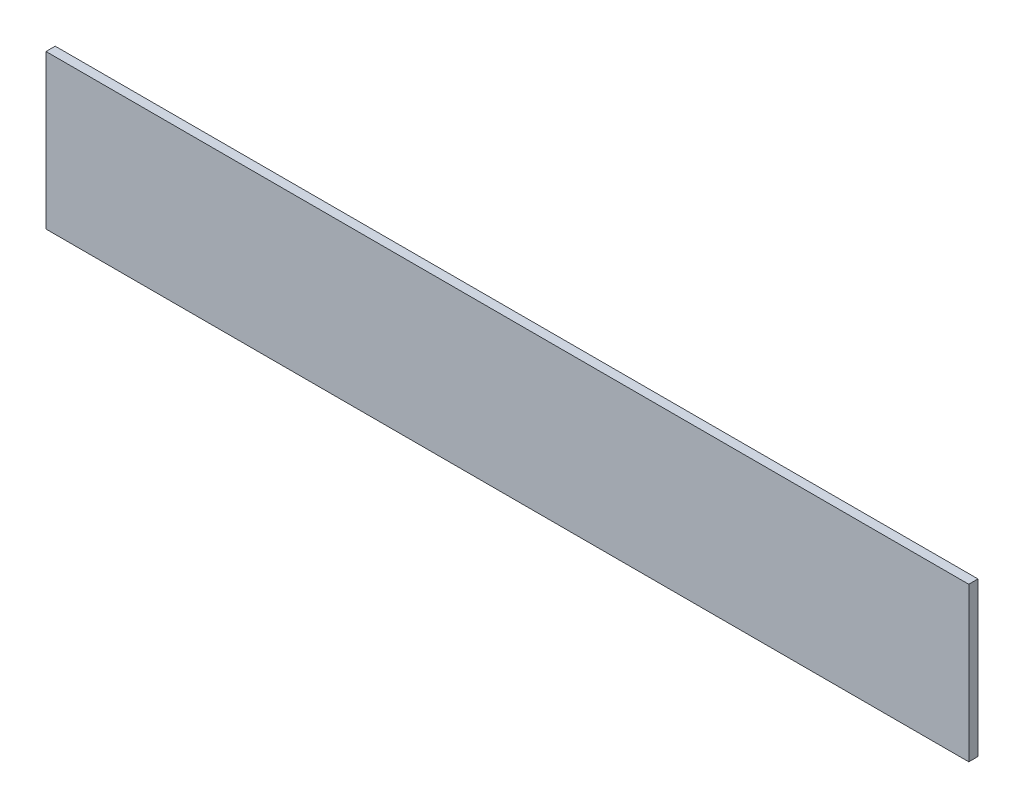
ISO-10303-21;
HEADER;
FILE_DESCRIPTION(('STEP AP214'),'2;1');
FILE_NAME('part.step','',(''),(''),'','','');
FILE_SCHEMA(('AUTOMOTIVE_DESIGN { 1 0 10303 214 1 1 1 1 }'));
ENDSEC;
DATA;
#1=APPLICATION_CONTEXT('core data for automotive mechanical design processes');
#2=APPLICATION_PROTOCOL_DEFINITION('international standard','automotive_design',2000,#1);
#3=PRODUCT_CONTEXT('',#1,'mechanical');
#4=PRODUCT('Part','Part','',(#3));
#5=PRODUCT_RELATED_PRODUCT_CATEGORY('part','',(#4));
#6=PRODUCT_DEFINITION_FORMATION('','',#4);
#7=PRODUCT_DEFINITION_CONTEXT('part definition',#1,'design');
#8=PRODUCT_DEFINITION('design','',#6,#7);
#9=PRODUCT_DEFINITION_SHAPE('','',#8);
#10=(LENGTH_UNIT() NAMED_UNIT(*) SI_UNIT(.MILLI.,.METRE.));
#11=(NAMED_UNIT(*) PLANE_ANGLE_UNIT() SI_UNIT($,.RADIAN.));
#12=(NAMED_UNIT(*) SI_UNIT($,.STERADIAN.) SOLID_ANGLE_UNIT());
#13=UNCERTAINTY_MEASURE_WITH_UNIT(LENGTH_MEASURE(1.E-05),#10,'distance_accuracy_value','');
#14=(GEOMETRIC_REPRESENTATION_CONTEXT(3) GLOBAL_UNCERTAINTY_ASSIGNED_CONTEXT((#13)) GLOBAL_UNIT_ASSIGNED_CONTEXT((#10,
#11,#12)) REPRESENTATION_CONTEXT('',''));
#15=CARTESIAN_POINT('',(0.,0.,0.));
#16=DIRECTION('',(0.,0.,1.));
#17=DIRECTION('',(1.,0.,0.));
#18=AXIS2_PLACEMENT_3D('',#15,#16,#17);
#19=CARTESIAN_POINT('',(150.,-25.,3.));
#20=DIRECTION('',(-1.,0.,0.));
#21=DIRECTION('',(0.,0.,1.));
#22=AXIS2_PLACEMENT_3D('',#19,#20,#21);
#23=PLANE('',#22);
#24=DIRECTION('',(0.,1.,0.));
#25=VECTOR('',#24,1.);
#26=CARTESIAN_POINT('',(150.,-25.,0.));
#27=LINE('',#26,#25);
#28=CARTESIAN_POINT('',(150.,-25.,0.));
#29=VERTEX_POINT('',#28);
#30=CARTESIAN_POINT('',(150.,25.,0.));
#31=VERTEX_POINT('',#30);
#32=EDGE_CURVE('E100',#29,#31,#27,.T.);
#33=ORIENTED_EDGE('',*,*,#32,.T.);
#34=DIRECTION('',(0.,0.,-1.));
#35=VECTOR('',#34,1.);
#36=CARTESIAN_POINT('',(150.,25.,3.));
#37=LINE('',#36,#35);
#38=CARTESIAN_POINT('',(150.,25.,3.));
#39=VERTEX_POINT('',#38);
#40=EDGE_CURVE('E11',#39,#31,#37,.T.);
#41=ORIENTED_EDGE('',*,*,#40,.F.);
#42=DIRECTION('',(0.,1.,0.));
#43=VECTOR('',#42,1.);
#44=CARTESIAN_POINT('',(150.,-25.,3.));
#45=LINE('',#44,#43);
#46=CARTESIAN_POINT('',(150.,-25.,3.));
#47=VERTEX_POINT('',#46);
#48=EDGE_CURVE('E88',#47,#39,#45,.T.);
#49=ORIENTED_EDGE('',*,*,#48,.F.);
#50=DIRECTION('',(0.,0.,-1.));
#51=VECTOR('',#50,1.);
#52=CARTESIAN_POINT('',(150.,-25.,3.));
#53=LINE('',#52,#51);
#54=EDGE_CURVE('E96',#47,#29,#53,.T.);
#55=ORIENTED_EDGE('',*,*,#54,.T.);
#56=EDGE_LOOP('',(#33,#41,#49,#55));
#57=FACE_BOUND('',#56,.T.);
#58=ADVANCED_FACE('F37',(#57),#23,.F.);
#59=CARTESIAN_POINT('',(-150.,25.,3.));
#60=DIRECTION('',(0.,-1.,0.));
#61=DIRECTION('',(0.,0.,-1.));
#62=AXIS2_PLACEMENT_3D('',#59,#60,#61);
#63=PLANE('',#62);
#64=DIRECTION('',(-1.,0.,0.));
#65=VECTOR('',#64,1.);
#66=CARTESIAN_POINT('',(-150.,25.,0.));
#67=LINE('',#66,#65);
#68=CARTESIAN_POINT('',(-150.,25.,0.));
#69=VERTEX_POINT('',#68);
#70=EDGE_CURVE('E92',#31,#69,#67,.T.);
#71=ORIENTED_EDGE('',*,*,#70,.T.);
#72=DIRECTION('',(0.,0.,-1.));
#73=VECTOR('',#72,1.);
#74=CARTESIAN_POINT('',(-150.,25.,3.));
#75=LINE('',#74,#73);
#76=CARTESIAN_POINT('',(-150.,25.,3.));
#77=VERTEX_POINT('',#76);
#78=EDGE_CURVE('E45',#77,#69,#75,.T.);
#79=ORIENTED_EDGE('',*,*,#78,.F.);
#80=DIRECTION('',(-1.,0.,0.));
#81=VECTOR('',#80,1.);
#82=CARTESIAN_POINT('',(-150.,25.,3.));
#83=LINE('',#82,#81);
#84=EDGE_CURVE('E83',#39,#77,#83,.T.);
#85=ORIENTED_EDGE('',*,*,#84,.F.);
#86=ORIENTED_EDGE('',*,*,#40,.T.);
#87=EDGE_LOOP('',(#71,#79,#85,#86));
#88=FACE_BOUND('',#87,.T.);
#89=ADVANCED_FACE('F91',(#88),#63,.F.);
#90=CARTESIAN_POINT('',(-150.,-25.,3.));
#91=DIRECTION('',(1.,0.,0.));
#92=DIRECTION('',(0.,0.,-1.));
#93=AXIS2_PLACEMENT_3D('',#90,#91,#92);
#94=PLANE('',#93);
#95=DIRECTION('',(0.,-1.,0.));
#96=VECTOR('',#95,1.);
#97=CARTESIAN_POINT('',(-150.,-25.,0.));
#98=LINE('',#97,#96);
#99=CARTESIAN_POINT('',(-150.,-25.,0.));
#100=VERTEX_POINT('',#99);
#101=EDGE_CURVE('E70',#69,#100,#98,.T.);
#102=ORIENTED_EDGE('',*,*,#101,.T.);
#103=DIRECTION('',(0.,0.,-1.));
#104=VECTOR('',#103,1.);
#105=CARTESIAN_POINT('',(-150.,-25.,3.));
#106=LINE('',#105,#104);
#107=CARTESIAN_POINT('',(-150.,-25.,3.));
#108=VERTEX_POINT('',#107);
#109=EDGE_CURVE('E93',#108,#100,#106,.T.);
#110=ORIENTED_EDGE('',*,*,#109,.F.);
#111=DIRECTION('',(0.,-1.,0.));
#112=VECTOR('',#111,1.);
#113=CARTESIAN_POINT('',(-150.,-25.,3.));
#114=LINE('',#113,#112);
#115=EDGE_CURVE('E86',#77,#108,#114,.T.);
#116=ORIENTED_EDGE('',*,*,#115,.F.);
#117=ORIENTED_EDGE('',*,*,#78,.T.);
#118=EDGE_LOOP('',(#102,#110,#116,#117));
#119=FACE_BOUND('',#118,.T.);
#120=ADVANCED_FACE('F94',(#119),#94,.F.);
#121=CARTESIAN_POINT('',(-150.,-25.,3.));
#122=DIRECTION('',(0.,1.,0.));
#123=DIRECTION('',(0.,0.,1.));
#124=AXIS2_PLACEMENT_3D('',#121,#122,#123);
#125=PLANE('',#124);
#126=DIRECTION('',(1.,0.,0.));
#127=VECTOR('',#126,1.);
#128=CARTESIAN_POINT('',(-150.,-25.,0.));
#129=LINE('',#128,#127);
#130=EDGE_CURVE('E76',#100,#29,#129,.T.);
#131=ORIENTED_EDGE('',*,*,#130,.T.);
#132=ORIENTED_EDGE('',*,*,#54,.F.);
#133=DIRECTION('',(1.,0.,0.));
#134=VECTOR('',#133,1.);
#135=CARTESIAN_POINT('',(-150.,-25.,3.));
#136=LINE('',#135,#134);
#137=EDGE_CURVE('E53',#108,#47,#136,.T.);
#138=ORIENTED_EDGE('',*,*,#137,.F.);
#139=ORIENTED_EDGE('',*,*,#109,.T.);
#140=EDGE_LOOP('',(#131,#132,#138,#139));
#141=FACE_BOUND('',#140,.T.);
#142=ADVANCED_FACE('F107',(#141),#125,.F.);
#143=CARTESIAN_POINT('',(0.,0.,3.));
#144=DIRECTION('',(0.,0.,-1.));
#145=DIRECTION('',(-1.,0.,0.));
#146=AXIS2_PLACEMENT_3D('',#143,#144,#145);
#147=PLANE('',#146);
#148=ORIENTED_EDGE('',*,*,#48,.T.);
#149=ORIENTED_EDGE('',*,*,#84,.T.);
#150=ORIENTED_EDGE('',*,*,#115,.T.);
#151=ORIENTED_EDGE('',*,*,#137,.T.);
#152=EDGE_LOOP('',(#148,#149,#150,#151));
#153=FACE_BOUND('',#152,.T.);
#154=ADVANCED_FACE('F84',(#153),#147,.F.);
#155=CARTESIAN_POINT('',(0.,0.,0.));
#156=DIRECTION('',(0.,0.,-1.));
#157=DIRECTION('',(-1.,0.,0.));
#158=AXIS2_PLACEMENT_3D('',#155,#156,#157);
#159=PLANE('',#158);
#160=ORIENTED_EDGE('',*,*,#32,.F.);
#161=ORIENTED_EDGE('',*,*,#130,.F.);
#162=ORIENTED_EDGE('',*,*,#101,.F.);
#163=ORIENTED_EDGE('',*,*,#70,.F.);
#164=EDGE_LOOP('',(#160,#161,#162,#163));
#165=FACE_BOUND('',#164,.T.);
#166=ADVANCED_FACE('F110',(#165),#159,.T.);
#167=CLOSED_SHELL('',(#58,#89,#120,#142,#154,#166));
#168=MANIFOLD_SOLID_BREP('B2',#167);
#169=ADVANCED_BREP_SHAPE_REPRESENTATION('',(#18,#168),#14);
#170=SHAPE_DEFINITION_REPRESENTATION(#9,#169);
ENDSEC;
END-ISO-10303-21;
